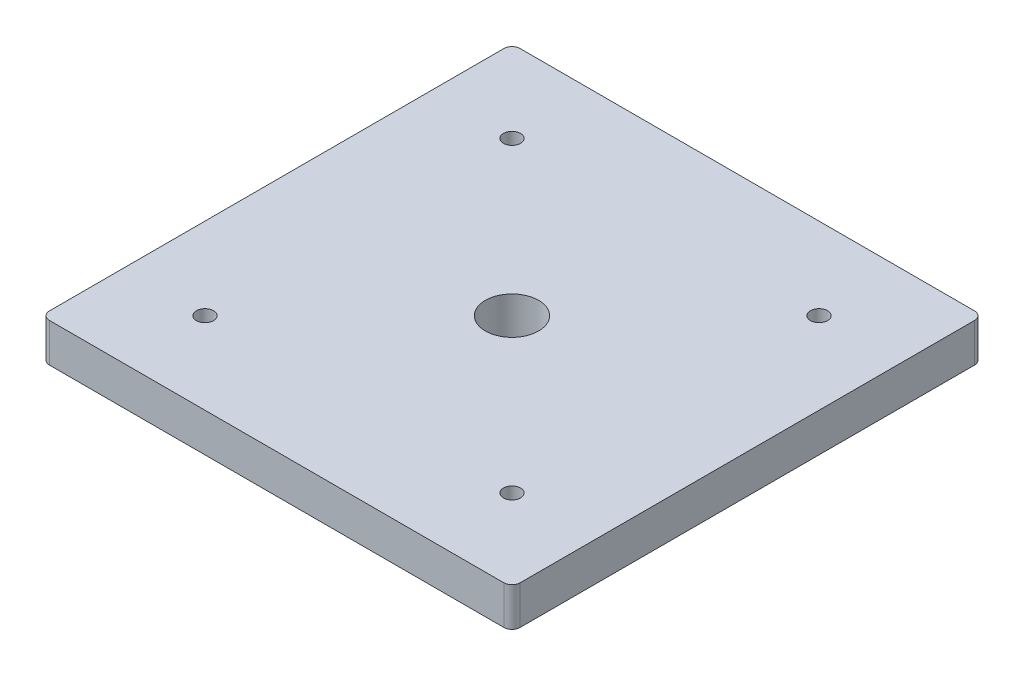
ISO-10303-21;
HEADER;
FILE_DESCRIPTION(('STEP AP214'),'2;1');
FILE_NAME('part.step','',(''),(''),'','','');
FILE_SCHEMA(('AUTOMOTIVE_DESIGN { 1 0 10303 214 1 1 1 1 }'));
ENDSEC;
DATA;
#1=APPLICATION_CONTEXT('core data for automotive mechanical design processes');
#2=APPLICATION_PROTOCOL_DEFINITION('international standard','automotive_design',2000,#1);
#3=PRODUCT_CONTEXT('',#1,'mechanical');
#4=PRODUCT('Part','Part','',(#3));
#5=PRODUCT_RELATED_PRODUCT_CATEGORY('part','',(#4));
#6=PRODUCT_DEFINITION_FORMATION('','',#4);
#7=PRODUCT_DEFINITION_CONTEXT('part definition',#1,'design');
#8=PRODUCT_DEFINITION('design','',#6,#7);
#9=PRODUCT_DEFINITION_SHAPE('','',#8);
#10=(LENGTH_UNIT() NAMED_UNIT(*) SI_UNIT(.MILLI.,.METRE.));
#11=(NAMED_UNIT(*) PLANE_ANGLE_UNIT() SI_UNIT($,.RADIAN.));
#12=(NAMED_UNIT(*) SI_UNIT($,.STERADIAN.) SOLID_ANGLE_UNIT());
#13=UNCERTAINTY_MEASURE_WITH_UNIT(LENGTH_MEASURE(1.E-05),#10,'distance_accuracy_value','');
#14=(GEOMETRIC_REPRESENTATION_CONTEXT(3) GLOBAL_UNCERTAINTY_ASSIGNED_CONTEXT((#13)) GLOBAL_UNIT_ASSIGNED_CONTEXT((#10,
#11,#12)) REPRESENTATION_CONTEXT('',''));
#15=CARTESIAN_POINT('',(0.,0.,0.));
#16=DIRECTION('',(0.,0.,1.));
#17=DIRECTION('',(1.,0.,0.));
#18=AXIS2_PLACEMENT_3D('',#15,#16,#17);
#19=CARTESIAN_POINT('',(-47.6250000000001,5.460000002,-47.6250000000001));
#20=DIRECTION('',(0.,-1.,0.));
#21=DIRECTION('',(0.,0.,-1.));
#22=AXIS2_PLACEMENT_3D('',#19,#20,#21);
#23=CYLINDRICAL_SURFACE('',#22,7.9375);
#24=CARTESIAN_POINT('',(-47.6250000000001,5.460000002,-47.6250000000001));
#25=DIRECTION('',(0.,-1.,0.));
#26=DIRECTION('',(0.,0.,-1.));
#27=AXIS2_PLACEMENT_3D('',#24,#25,#26);
#28=CIRCLE('',#27,7.9375);
#29=CARTESIAN_POINT('',(-47.6250000000001,5.460000002,-55.5625000000001));
#30=VERTEX_POINT('',#29);
#31=EDGE_CURVE('E180',#30,#30,#28,.T.);
#32=ORIENTED_EDGE('',*,*,#31,.F.);
#33=EDGE_LOOP('',(#32));
#34=FACE_BOUND('',#33,.T.);
#35=CARTESIAN_POINT('',(-47.6250000000001,0.,-47.6250000000001));
#36=DIRECTION('',(0.,-1.,0.));
#37=DIRECTION('',(0.,0.,-1.));
#38=AXIS2_PLACEMENT_3D('',#35,#36,#37);
#39=CIRCLE('',#38,7.9375);
#40=CARTESIAN_POINT('',(-47.6250000000001,0.,-55.5625000000001));
#41=VERTEX_POINT('',#40);
#42=EDGE_CURVE('E177',#41,#41,#39,.T.);
#43=ORIENTED_EDGE('',*,*,#42,.T.);
#44=EDGE_LOOP('',(#43));
#45=FACE_BOUND('',#44,.T.);
#46=ADVANCED_FACE('F17',(#34,#45),#23,.F.);
#47=CARTESIAN_POINT('',(47.6249999999999,5.460000002,-47.6250000000001));
#48=DIRECTION('',(0.,-1.,0.));
#49=DIRECTION('',(0.,0.,-1.));
#50=AXIS2_PLACEMENT_3D('',#47,#48,#49);
#51=CYLINDRICAL_SURFACE('',#50,7.9375);
#52=CARTESIAN_POINT('',(47.6249999999999,5.460000002,-47.6250000000001));
#53=DIRECTION('',(0.,-1.,0.));
#54=DIRECTION('',(0.,0.,-1.));
#55=AXIS2_PLACEMENT_3D('',#52,#53,#54);
#56=CIRCLE('',#55,7.9375);
#57=CARTESIAN_POINT('',(47.6249999999999,5.460000002,-55.5625000000001));
#58=VERTEX_POINT('',#57);
#59=EDGE_CURVE('E183',#58,#58,#56,.T.);
#60=ORIENTED_EDGE('',*,*,#59,.F.);
#61=EDGE_LOOP('',(#60));
#62=FACE_BOUND('',#61,.T.);
#63=CARTESIAN_POINT('',(47.6249999999999,0.,-47.6250000000001));
#64=DIRECTION('',(0.,-1.,0.));
#65=DIRECTION('',(0.,0.,-1.));
#66=AXIS2_PLACEMENT_3D('',#63,#64,#65);
#67=CIRCLE('',#66,7.9375);
#68=CARTESIAN_POINT('',(47.6249999999999,0.,-55.5625000000001));
#69=VERTEX_POINT('',#68);
#70=EDGE_CURVE('E174',#69,#69,#67,.T.);
#71=ORIENTED_EDGE('',*,*,#70,.T.);
#72=EDGE_LOOP('',(#71));
#73=FACE_BOUND('',#72,.T.);
#74=ADVANCED_FACE('F213',(#62,#73),#51,.F.);
#75=CARTESIAN_POINT('',(47.625,5.460000002,47.6249999999999));
#76=DIRECTION('',(0.,-1.,0.));
#77=DIRECTION('',(0.,0.,-1.));
#78=AXIS2_PLACEMENT_3D('',#75,#76,#77);
#79=CYLINDRICAL_SURFACE('',#78,7.9375);
#80=CARTESIAN_POINT('',(47.625,5.460000002,47.6249999999999));
#81=DIRECTION('',(0.,-1.,0.));
#82=DIRECTION('',(0.,0.,-1.));
#83=AXIS2_PLACEMENT_3D('',#80,#81,#82);
#84=CIRCLE('',#83,7.9375);
#85=CARTESIAN_POINT('',(47.625,5.460000002,39.6874999999999));
#86=VERTEX_POINT('',#85);
#87=EDGE_CURVE('E185',#86,#86,#84,.T.);
#88=ORIENTED_EDGE('',*,*,#87,.F.);
#89=EDGE_LOOP('',(#88));
#90=FACE_BOUND('',#89,.T.);
#91=CARTESIAN_POINT('',(47.625,0.,47.6249999999999));
#92=DIRECTION('',(0.,-1.,0.));
#93=DIRECTION('',(0.,0.,-1.));
#94=AXIS2_PLACEMENT_3D('',#91,#92,#93);
#95=CIRCLE('',#94,7.9375);
#96=CARTESIAN_POINT('',(47.625,0.,39.6874999999999));
#97=VERTEX_POINT('',#96);
#98=EDGE_CURVE('E171',#97,#97,#95,.T.);
#99=ORIENTED_EDGE('',*,*,#98,.T.);
#100=EDGE_LOOP('',(#99));
#101=FACE_BOUND('',#100,.T.);
#102=ADVANCED_FACE('F197',(#90,#101),#79,.F.);
#103=CARTESIAN_POINT('',(-47.625,5.460000002,47.6249999999999));
#104=DIRECTION('',(0.,-1.,0.));
#105=DIRECTION('',(0.,0.,-1.));
#106=AXIS2_PLACEMENT_3D('',#103,#104,#105);
#107=CYLINDRICAL_SURFACE('',#106,7.9375);
#108=CARTESIAN_POINT('',(-47.625,5.460000002,47.6249999999999));
#109=DIRECTION('',(0.,-1.,0.));
#110=DIRECTION('',(0.,0.,-1.));
#111=AXIS2_PLACEMENT_3D('',#108,#109,#110);
#112=CIRCLE('',#111,7.9375);
#113=CARTESIAN_POINT('',(-47.625,5.460000002,39.6874999999999));
#114=VERTEX_POINT('',#113);
#115=EDGE_CURVE('E20',#114,#114,#112,.T.);
#116=ORIENTED_EDGE('',*,*,#115,.F.);
#117=EDGE_LOOP('',(#116));
#118=FACE_BOUND('',#117,.T.);
#119=CARTESIAN_POINT('',(-47.625,0.,47.6249999999999));
#120=DIRECTION('',(0.,-1.,0.));
#121=DIRECTION('',(0.,0.,-1.));
#122=AXIS2_PLACEMENT_3D('',#119,#120,#121);
#123=CIRCLE('',#122,7.9375);
#124=CARTESIAN_POINT('',(-47.625,0.,39.6874999999999));
#125=VERTEX_POINT('',#124);
#126=EDGE_CURVE('E168',#125,#125,#123,.T.);
#127=ORIENTED_EDGE('',*,*,#126,.T.);
#128=EDGE_LOOP('',(#127));
#129=FACE_BOUND('',#128,.T.);
#130=ADVANCED_FACE('F194',(#118,#129),#107,.F.);
#131=CARTESIAN_POINT('',(-47.625,5.460000002,47.6249999999999));
#132=DIRECTION('',(0.,-1.,0.));
#133=DIRECTION('',(0.,0.,-1.));
#134=AXIS2_PLACEMENT_3D('',#131,#132,#133);
#135=PLANE('',#134);
#136=CARTESIAN_POINT('',(-47.625,5.460000002,47.6249999999999));
#137=DIRECTION('',(0.,-1.,0.));
#138=DIRECTION('',(0.,0.,-1.));
#139=AXIS2_PLACEMENT_3D('',#136,#137,#138);
#140=CIRCLE('',#139,2.667);
#141=CARTESIAN_POINT('',(-47.625,5.460000002,44.9579999999999));
#142=VERTEX_POINT('',#141);
#143=EDGE_CURVE('E165',#142,#142,#140,.F.);
#144=ORIENTED_EDGE('',*,*,#143,.T.);
#145=EDGE_LOOP('',(#144));
#146=FACE_BOUND('',#145,.T.);
#147=ORIENTED_EDGE('',*,*,#115,.T.);
#148=EDGE_LOOP('',(#147));
#149=FACE_BOUND('',#148,.T.);
#150=ADVANCED_FACE('F192',(#146,#149),#135,.T.);
#151=CARTESIAN_POINT('',(47.625,5.460000002,47.6249999999999));
#152=DIRECTION('',(0.,-1.,0.));
#153=DIRECTION('',(0.,0.,-1.));
#154=AXIS2_PLACEMENT_3D('',#151,#152,#153);
#155=PLANE('',#154);
#156=CARTESIAN_POINT('',(47.625,5.460000002,47.6249999999999));
#157=DIRECTION('',(0.,-1.,0.));
#158=DIRECTION('',(0.,0.,-1.));
#159=AXIS2_PLACEMENT_3D('',#156,#157,#158);
#160=CIRCLE('',#159,2.667);
#161=CARTESIAN_POINT('',(47.625,5.460000002,44.9579999999999));
#162=VERTEX_POINT('',#161);
#163=EDGE_CURVE('E162',#162,#162,#160,.F.);
#164=ORIENTED_EDGE('',*,*,#163,.T.);
#165=EDGE_LOOP('',(#164));
#166=FACE_BOUND('',#165,.T.);
#167=ORIENTED_EDGE('',*,*,#87,.T.);
#168=EDGE_LOOP('',(#167));
#169=FACE_BOUND('',#168,.T.);
#170=ADVANCED_FACE('F280',(#166,#169),#155,.T.);
#171=CARTESIAN_POINT('',(47.6249999999999,5.460000002,-47.6250000000001));
#172=DIRECTION('',(0.,-1.,0.));
#173=DIRECTION('',(0.,0.,-1.));
#174=AXIS2_PLACEMENT_3D('',#171,#172,#173);
#175=PLANE('',#174);
#176=CARTESIAN_POINT('',(47.6249999999999,5.460000002,-47.6250000000001));
#177=DIRECTION('',(0.,-1.,0.));
#178=DIRECTION('',(0.,0.,-1.));
#179=AXIS2_PLACEMENT_3D('',#176,#177,#178);
#180=CIRCLE('',#179,2.667);
#181=CARTESIAN_POINT('',(47.6249999999999,5.460000002,-50.2920000000001));
#182=VERTEX_POINT('',#181);
#183=EDGE_CURVE('E159',#182,#182,#180,.F.);
#184=ORIENTED_EDGE('',*,*,#183,.T.);
#185=EDGE_LOOP('',(#184));
#186=FACE_BOUND('',#185,.T.);
#187=ORIENTED_EDGE('',*,*,#59,.T.);
#188=EDGE_LOOP('',(#187));
#189=FACE_BOUND('',#188,.T.);
#190=ADVANCED_FACE('F276',(#186,#189),#175,.T.);
#191=CARTESIAN_POINT('',(-47.6250000000001,5.460000002,-47.6250000000001));
#192=DIRECTION('',(0.,-1.,0.));
#193=DIRECTION('',(0.,0.,-1.));
#194=AXIS2_PLACEMENT_3D('',#191,#192,#193);
#195=PLANE('',#194);
#196=CARTESIAN_POINT('',(-47.6250000000001,5.460000002,-47.6250000000001));
#197=DIRECTION('',(0.,-1.,0.));
#198=DIRECTION('',(0.,0.,-1.));
#199=AXIS2_PLACEMENT_3D('',#196,#197,#198);
#200=CIRCLE('',#199,2.667);
#201=CARTESIAN_POINT('',(-47.6250000000001,5.460000002,-50.2920000000001));
#202=VERTEX_POINT('',#201);
#203=EDGE_CURVE('E113',#202,#202,#200,.F.);
#204=ORIENTED_EDGE('',*,*,#203,.T.);
#205=EDGE_LOOP('',(#204));
#206=FACE_BOUND('',#205,.T.);
#207=ORIENTED_EDGE('',*,*,#31,.T.);
#208=EDGE_LOOP('',(#207));
#209=FACE_BOUND('',#208,.T.);
#210=ADVANCED_FACE('F203',(#206,#209),#195,.T.);
#211=CARTESIAN_POINT('',(0.,0.,0.));
#212=DIRECTION('',(0.,1.,0.));
#213=DIRECTION('',(0.,0.,1.));
#214=AXIS2_PLACEMENT_3D('',#211,#212,#213);
#215=PLANE('',#214);
#216=CARTESIAN_POINT('',(0.,0.,0.));
#217=DIRECTION('',(0.,-1.,0.));
#218=DIRECTION('',(0.,0.,-1.));
#219=AXIS2_PLACEMENT_3D('',#216,#217,#218);
#220=CIRCLE('',#219,8.255);
#221=CARTESIAN_POINT('',(0.,0.,-8.255));
#222=VERTEX_POINT('',#221);
#223=EDGE_CURVE('E146',#222,#222,#220,.F.);
#224=ORIENTED_EDGE('',*,*,#223,.T.);
#225=EDGE_LOOP('',(#224));
#226=FACE_BOUND('',#225,.T.);
#227=CARTESIAN_POINT('',(-70.485,0.,-70.485));
#228=DIRECTION('',(0.,-1.,0.));
#229=DIRECTION('',(0.,0.,-1.));
#230=AXIS2_PLACEMENT_3D('',#227,#228,#229);
#231=CIRCLE('',#230,2.54);
#232=CARTESIAN_POINT('',(-70.485,0.,-73.025));
#233=VERTEX_POINT('',#232);
#234=CARTESIAN_POINT('',(-73.025,0.,-70.485));
#235=VERTEX_POINT('',#234);
#236=EDGE_CURVE('E87',#233,#235,#231,.F.);
#237=ORIENTED_EDGE('',*,*,#236,.F.);
#238=DIRECTION('',(1.,0.,0.));
#239=VECTOR('',#238,1.);
#240=CARTESIAN_POINT('',(73.025,0.,-73.025));
#241=LINE('',#240,#239);
#242=CARTESIAN_POINT('',(70.485,0.,-73.025));
#243=VERTEX_POINT('',#242);
#244=EDGE_CURVE('E78',#233,#243,#241,.T.);
#245=ORIENTED_EDGE('',*,*,#244,.T.);
#246=CARTESIAN_POINT('',(70.485,0.,-70.485));
#247=DIRECTION('',(0.,-1.,0.));
#248=DIRECTION('',(0.,0.,-1.));
#249=AXIS2_PLACEMENT_3D('',#246,#247,#248);
#250=CIRCLE('',#249,2.54);
#251=CARTESIAN_POINT('',(73.025,0.,-70.485));
#252=VERTEX_POINT('',#251);
#253=EDGE_CURVE('E150',#252,#243,#250,.F.);
#254=ORIENTED_EDGE('',*,*,#253,.F.);
#255=DIRECTION('',(0.,0.,1.));
#256=VECTOR('',#255,1.);
#257=CARTESIAN_POINT('',(73.025,0.,73.025));
#258=LINE('',#257,#256);
#259=CARTESIAN_POINT('',(73.025,0.,70.485));
#260=VERTEX_POINT('',#259);
#261=EDGE_CURVE('E114',#252,#260,#258,.T.);
#262=ORIENTED_EDGE('',*,*,#261,.T.);
#263=CARTESIAN_POINT('',(70.485,0.,70.485));
#264=DIRECTION('',(0.,-1.,0.));
#265=DIRECTION('',(0.,0.,-1.));
#266=AXIS2_PLACEMENT_3D('',#263,#264,#265);
#267=CIRCLE('',#266,2.54);
#268=CARTESIAN_POINT('',(70.485,0.,73.025));
#269=VERTEX_POINT('',#268);
#270=EDGE_CURVE('E153',#269,#260,#267,.F.);
#271=ORIENTED_EDGE('',*,*,#270,.F.);
#272=DIRECTION('',(-1.,0.,0.));
#273=VECTOR('',#272,1.);
#274=CARTESIAN_POINT('',(73.025,0.,73.025));
#275=LINE('',#274,#273);
#276=CARTESIAN_POINT('',(-70.485,0.,73.025));
#277=VERTEX_POINT('',#276);
#278=EDGE_CURVE('E118',#269,#277,#275,.T.);
#279=ORIENTED_EDGE('',*,*,#278,.T.);
#280=CARTESIAN_POINT('',(-70.485,0.,70.485));
#281=DIRECTION('',(0.,-1.,0.));
#282=DIRECTION('',(0.,0.,-1.));
#283=AXIS2_PLACEMENT_3D('',#280,#281,#282);
#284=CIRCLE('',#283,2.54);
#285=CARTESIAN_POINT('',(-73.025,0.,70.485));
#286=VERTEX_POINT('',#285);
#287=EDGE_CURVE('E90',#286,#277,#284,.F.);
#288=ORIENTED_EDGE('',*,*,#287,.F.);
#289=DIRECTION('',(0.,0.,-1.));
#290=VECTOR('',#289,1.);
#291=CARTESIAN_POINT('',(-73.025,0.,73.025));
#292=LINE('',#291,#290);
#293=EDGE_CURVE('E83',#286,#235,#292,.T.);
#294=ORIENTED_EDGE('',*,*,#293,.T.);
#295=EDGE_LOOP('',(#237,#245,#254,#262,#271,#279,#288,#294));
#296=FACE_BOUND('',#295,.T.);
#297=ORIENTED_EDGE('',*,*,#126,.F.);
#298=EDGE_LOOP('',(#297));
#299=FACE_BOUND('',#298,.T.);
#300=ORIENTED_EDGE('',*,*,#98,.F.);
#301=EDGE_LOOP('',(#300));
#302=FACE_BOUND('',#301,.T.);
#303=ORIENTED_EDGE('',*,*,#70,.F.);
#304=EDGE_LOOP('',(#303));
#305=FACE_BOUND('',#304,.T.);
#306=ORIENTED_EDGE('',*,*,#42,.F.);
#307=EDGE_LOOP('',(#306));
#308=FACE_BOUND('',#307,.T.);
#309=ADVANCED_FACE('F85',(#226,#296,#299,#302,#305,#308),#215,.F.);
#310=CARTESIAN_POINT('',(-47.625,12.,47.6249999999999));
#311=DIRECTION('',(0.,-1.,0.));
#312=DIRECTION('',(0.,0.,-1.));
#313=AXIS2_PLACEMENT_3D('',#310,#311,#312);
#314=CYLINDRICAL_SURFACE('',#313,2.667);
#315=ORIENTED_EDGE('',*,*,#143,.F.);
#316=EDGE_LOOP('',(#315));
#317=FACE_BOUND('',#316,.T.);
#318=CARTESIAN_POINT('',(-47.625,12.,47.6249999999999));
#319=DIRECTION('',(0.,-1.,0.));
#320=DIRECTION('',(0.,0.,-1.));
#321=AXIS2_PLACEMENT_3D('',#318,#319,#320);
#322=CIRCLE('',#321,2.667);
#323=CARTESIAN_POINT('',(-47.625,12.,44.9579999999999));
#324=VERTEX_POINT('',#323);
#325=EDGE_CURVE('E143',#324,#324,#322,.T.);
#326=ORIENTED_EDGE('',*,*,#325,.F.);
#327=EDGE_LOOP('',(#326));
#328=FACE_BOUND('',#327,.T.);
#329=ADVANCED_FACE('F202',(#317,#328),#314,.F.);
#330=CARTESIAN_POINT('',(47.625,12.,47.6249999999999));
#331=DIRECTION('',(0.,-1.,0.));
#332=DIRECTION('',(0.,0.,-1.));
#333=AXIS2_PLACEMENT_3D('',#330,#331,#332);
#334=CYLINDRICAL_SURFACE('',#333,2.667);
#335=ORIENTED_EDGE('',*,*,#163,.F.);
#336=EDGE_LOOP('',(#335));
#337=FACE_BOUND('',#336,.T.);
#338=CARTESIAN_POINT('',(47.625,12.,47.6249999999999));
#339=DIRECTION('',(0.,-1.,0.));
#340=DIRECTION('',(0.,0.,-1.));
#341=AXIS2_PLACEMENT_3D('',#338,#339,#340);
#342=CIRCLE('',#341,2.667);
#343=CARTESIAN_POINT('',(47.625,12.,44.9579999999999));
#344=VERTEX_POINT('',#343);
#345=EDGE_CURVE('E140',#344,#344,#342,.T.);
#346=ORIENTED_EDGE('',*,*,#345,.F.);
#347=EDGE_LOOP('',(#346));
#348=FACE_BOUND('',#347,.T.);
#349=ADVANCED_FACE('F266',(#337,#348),#334,.F.);
#350=CARTESIAN_POINT('',(47.6249999999999,12.,-47.6250000000001));
#351=DIRECTION('',(0.,-1.,0.));
#352=DIRECTION('',(0.,0.,-1.));
#353=AXIS2_PLACEMENT_3D('',#350,#351,#352);
#354=CYLINDRICAL_SURFACE('',#353,2.667);
#355=ORIENTED_EDGE('',*,*,#183,.F.);
#356=EDGE_LOOP('',(#355));
#357=FACE_BOUND('',#356,.T.);
#358=CARTESIAN_POINT('',(47.6249999999999,12.,-47.6250000000001));
#359=DIRECTION('',(0.,-1.,0.));
#360=DIRECTION('',(0.,0.,-1.));
#361=AXIS2_PLACEMENT_3D('',#358,#359,#360);
#362=CIRCLE('',#361,2.667);
#363=CARTESIAN_POINT('',(47.6249999999999,12.,-50.2920000000001));
#364=VERTEX_POINT('',#363);
#365=EDGE_CURVE('E137',#364,#364,#362,.T.);
#366=ORIENTED_EDGE('',*,*,#365,.F.);
#367=EDGE_LOOP('',(#366));
#368=FACE_BOUND('',#367,.T.);
#369=ADVANCED_FACE('F262',(#357,#368),#354,.F.);
#370=CARTESIAN_POINT('',(-47.6250000000001,12.,-47.6250000000001));
#371=DIRECTION('',(0.,-1.,0.));
#372=DIRECTION('',(0.,0.,-1.));
#373=AXIS2_PLACEMENT_3D('',#370,#371,#372);
#374=CYLINDRICAL_SURFACE('',#373,2.667);
#375=ORIENTED_EDGE('',*,*,#203,.F.);
#376=EDGE_LOOP('',(#375));
#377=FACE_BOUND('',#376,.T.);
#378=CARTESIAN_POINT('',(-47.6250000000001,12.,-47.6250000000001));
#379=DIRECTION('',(0.,-1.,0.));
#380=DIRECTION('',(0.,0.,-1.));
#381=AXIS2_PLACEMENT_3D('',#378,#379,#380);
#382=CIRCLE('',#381,2.667);
#383=CARTESIAN_POINT('',(-47.6250000000001,12.,-50.2920000000001));
#384=VERTEX_POINT('',#383);
#385=EDGE_CURVE('E134',#384,#384,#382,.T.);
#386=ORIENTED_EDGE('',*,*,#385,.F.);
#387=EDGE_LOOP('',(#386));
#388=FACE_BOUND('',#387,.T.);
#389=ADVANCED_FACE('F259',(#377,#388),#374,.F.);
#390=CARTESIAN_POINT('',(73.025,12.,-73.025));
#391=DIRECTION('',(0.,0.,1.));
#392=DIRECTION('',(1.,0.,0.));
#393=AXIS2_PLACEMENT_3D('',#390,#391,#392);
#394=PLANE('',#393);
#395=DIRECTION('',(0.,-1.,0.));
#396=VECTOR('',#395,1.);
#397=CARTESIAN_POINT('',(-70.485,12.,-73.025));
#398=LINE('',#397,#396);
#399=CARTESIAN_POINT('',(-70.485,12.,-73.025));
#400=VERTEX_POINT('',#399);
#401=EDGE_CURVE('E100',#400,#233,#398,.T.);
#402=ORIENTED_EDGE('',*,*,#401,.F.);
#403=DIRECTION('',(1.,0.,0.));
#404=VECTOR('',#403,1.);
#405=CARTESIAN_POINT('',(0.,12.,-73.025));
#406=LINE('',#405,#404);
#407=CARTESIAN_POINT('',(70.485,12.,-73.025));
#408=VERTEX_POINT('',#407);
#409=EDGE_CURVE('E133',#408,#400,#406,.F.);
#410=ORIENTED_EDGE('',*,*,#409,.F.);
#411=DIRECTION('',(0.,-1.,0.));
#412=VECTOR('',#411,1.);
#413=CARTESIAN_POINT('',(70.485,12.,-73.025));
#414=LINE('',#413,#412);
#415=EDGE_CURVE('E149',#243,#408,#414,.F.);
#416=ORIENTED_EDGE('',*,*,#415,.F.);
#417=ORIENTED_EDGE('',*,*,#244,.F.);
#418=EDGE_LOOP('',(#402,#410,#416,#417));
#419=FACE_BOUND('',#418,.T.);
#420=ADVANCED_FACE('F256',(#419),#394,.F.);
#421=CARTESIAN_POINT('',(-70.485,12.,-70.485));
#422=DIRECTION('',(0.,-1.,0.));
#423=DIRECTION('',(0.,0.,-1.));
#424=AXIS2_PLACEMENT_3D('',#421,#422,#423);
#425=CYLINDRICAL_SURFACE('',#424,2.54);
#426=ORIENTED_EDGE('',*,*,#236,.T.);
#427=DIRECTION('',(0.,1.,0.));
#428=VECTOR('',#427,1.);
#429=CARTESIAN_POINT('',(-73.025,12.,-70.485));
#430=LINE('',#429,#428);
#431=CARTESIAN_POINT('',(-73.025,12.,-70.485));
#432=VERTEX_POINT('',#431);
#433=EDGE_CURVE('E94',#235,#432,#430,.T.);
#434=ORIENTED_EDGE('',*,*,#433,.T.);
#435=CARTESIAN_POINT('',(-70.485,12.,-70.485));
#436=DIRECTION('',(0.,-1.,0.));
#437=DIRECTION('',(0.,0.,-1.));
#438=AXIS2_PLACEMENT_3D('',#435,#436,#437);
#439=CIRCLE('',#438,2.54);
#440=EDGE_CURVE('E131',#400,#432,#439,.F.);
#441=ORIENTED_EDGE('',*,*,#440,.F.);
#442=ORIENTED_EDGE('',*,*,#401,.T.);
#443=EDGE_LOOP('',(#426,#434,#441,#442));
#444=FACE_BOUND('',#443,.T.);
#445=ADVANCED_FACE('F97',(#444),#425,.T.);
#446=CARTESIAN_POINT('',(-73.025,12.,73.025));
#447=DIRECTION('',(1.,0.,0.));
#448=DIRECTION('',(0.,0.,-1.));
#449=AXIS2_PLACEMENT_3D('',#446,#447,#448);
#450=PLANE('',#449);
#451=ORIENTED_EDGE('',*,*,#433,.F.);
#452=ORIENTED_EDGE('',*,*,#293,.F.);
#453=DIRECTION('',(0.,-1.,0.));
#454=VECTOR('',#453,1.);
#455=CARTESIAN_POINT('',(-73.025,12.,70.485));
#456=LINE('',#455,#454);
#457=CARTESIAN_POINT('',(-73.025,12.,70.485));
#458=VERTEX_POINT('',#457);
#459=EDGE_CURVE('E106',#458,#286,#456,.T.);
#460=ORIENTED_EDGE('',*,*,#459,.F.);
#461=DIRECTION('',(0.,0.,1.));
#462=VECTOR('',#461,1.);
#463=CARTESIAN_POINT('',(-73.025,12.,0.));
#464=LINE('',#463,#462);
#465=EDGE_CURVE('E104',#432,#458,#464,.T.);
#466=ORIENTED_EDGE('',*,*,#465,.F.);
#467=EDGE_LOOP('',(#451,#452,#460,#466));
#468=FACE_BOUND('',#467,.T.);
#469=ADVANCED_FACE('F102',(#468),#450,.F.);
#470=CARTESIAN_POINT('',(-70.485,12.,70.485));
#471=DIRECTION('',(0.,-1.,0.));
#472=DIRECTION('',(0.,0.,-1.));
#473=AXIS2_PLACEMENT_3D('',#470,#471,#472);
#474=CYLINDRICAL_SURFACE('',#473,2.54);
#475=ORIENTED_EDGE('',*,*,#287,.T.);
#476=DIRECTION('',(0.,1.,0.));
#477=VECTOR('',#476,1.);
#478=CARTESIAN_POINT('',(-70.485,12.,73.025));
#479=LINE('',#478,#477);
#480=CARTESIAN_POINT('',(-70.485,12.,73.025));
#481=VERTEX_POINT('',#480);
#482=EDGE_CURVE('E119',#277,#481,#479,.T.);
#483=ORIENTED_EDGE('',*,*,#482,.T.);
#484=CARTESIAN_POINT('',(-70.485,12.,70.485));
#485=DIRECTION('',(0.,-1.,0.));
#486=DIRECTION('',(0.,0.,-1.));
#487=AXIS2_PLACEMENT_3D('',#484,#485,#486);
#488=CIRCLE('',#487,2.54);
#489=EDGE_CURVE('E128',#458,#481,#488,.F.);
#490=ORIENTED_EDGE('',*,*,#489,.F.);
#491=ORIENTED_EDGE('',*,*,#459,.T.);
#492=EDGE_LOOP('',(#475,#483,#490,#491));
#493=FACE_BOUND('',#492,.T.);
#494=ADVANCED_FACE('F247',(#493),#474,.T.);
#495=CARTESIAN_POINT('',(73.025,12.,73.025));
#496=DIRECTION('',(0.,0.,-1.));
#497=DIRECTION('',(-1.,0.,0.));
#498=AXIS2_PLACEMENT_3D('',#495,#496,#497);
#499=PLANE('',#498);
#500=ORIENTED_EDGE('',*,*,#482,.F.);
#501=ORIENTED_EDGE('',*,*,#278,.F.);
#502=DIRECTION('',(0.,-1.,0.));
#503=VECTOR('',#502,1.);
#504=CARTESIAN_POINT('',(70.485,12.,73.025));
#505=LINE('',#504,#503);
#506=CARTESIAN_POINT('',(70.485,12.,73.025));
#507=VERTEX_POINT('',#506);
#508=EDGE_CURVE('E155',#507,#269,#505,.T.);
#509=ORIENTED_EDGE('',*,*,#508,.F.);
#510=DIRECTION('',(1.,0.,0.));
#511=VECTOR('',#510,1.);
#512=CARTESIAN_POINT('',(0.,12.,73.025));
#513=LINE('',#512,#511);
#514=EDGE_CURVE('E127',#481,#507,#513,.T.);
#515=ORIENTED_EDGE('',*,*,#514,.F.);
#516=EDGE_LOOP('',(#500,#501,#509,#515));
#517=FACE_BOUND('',#516,.T.);
#518=ADVANCED_FACE('F243',(#517),#499,.F.);
#519=CARTESIAN_POINT('',(70.485,12.,70.485));
#520=DIRECTION('',(0.,-1.,0.));
#521=DIRECTION('',(0.,0.,-1.));
#522=AXIS2_PLACEMENT_3D('',#519,#520,#521);
#523=CYLINDRICAL_SURFACE('',#522,2.54);
#524=ORIENTED_EDGE('',*,*,#270,.T.);
#525=DIRECTION('',(0.,1.,0.));
#526=VECTOR('',#525,1.);
#527=CARTESIAN_POINT('',(73.025,12.,70.485));
#528=LINE('',#527,#526);
#529=CARTESIAN_POINT('',(73.025,12.,70.485));
#530=VERTEX_POINT('',#529);
#531=EDGE_CURVE('E117',#260,#530,#528,.T.);
#532=ORIENTED_EDGE('',*,*,#531,.T.);
#533=CARTESIAN_POINT('',(70.485,12.,70.485));
#534=DIRECTION('',(0.,-1.,0.));
#535=DIRECTION('',(0.,0.,-1.));
#536=AXIS2_PLACEMENT_3D('',#533,#534,#535);
#537=CIRCLE('',#536,2.54);
#538=EDGE_CURVE('E124',#507,#530,#537,.F.);
#539=ORIENTED_EDGE('',*,*,#538,.F.);
#540=ORIENTED_EDGE('',*,*,#508,.T.);
#541=EDGE_LOOP('',(#524,#532,#539,#540));
#542=FACE_BOUND('',#541,.T.);
#543=ADVANCED_FACE('F240',(#542),#523,.T.);
#544=CARTESIAN_POINT('',(73.025,12.,73.025));
#545=DIRECTION('',(-1.,0.,0.));
#546=DIRECTION('',(0.,0.,1.));
#547=AXIS2_PLACEMENT_3D('',#544,#545,#546);
#548=PLANE('',#547);
#549=DIRECTION('',(0.,-1.,0.));
#550=VECTOR('',#549,1.);
#551=CARTESIAN_POINT('',(73.025,12.,-70.485));
#552=LINE('',#551,#550);
#553=CARTESIAN_POINT('',(73.025,12.,-70.485));
#554=VERTEX_POINT('',#553);
#555=EDGE_CURVE('E35',#554,#252,#552,.T.);
#556=ORIENTED_EDGE('',*,*,#555,.F.);
#557=DIRECTION('',(0.,0.,1.));
#558=VECTOR('',#557,1.);
#559=CARTESIAN_POINT('',(73.025,12.,0.));
#560=LINE('',#559,#558);
#561=EDGE_CURVE('E123',#530,#554,#560,.F.);
#562=ORIENTED_EDGE('',*,*,#561,.F.);
#563=ORIENTED_EDGE('',*,*,#531,.F.);
#564=ORIENTED_EDGE('',*,*,#261,.F.);
#565=EDGE_LOOP('',(#556,#562,#563,#564));
#566=FACE_BOUND('',#565,.T.);
#567=ADVANCED_FACE('F236',(#566),#548,.F.);
#568=CARTESIAN_POINT('',(70.485,12.,-70.485));
#569=DIRECTION('',(0.,-1.,0.));
#570=DIRECTION('',(0.,0.,-1.));
#571=AXIS2_PLACEMENT_3D('',#568,#569,#570);
#572=CYLINDRICAL_SURFACE('',#571,2.54);
#573=ORIENTED_EDGE('',*,*,#253,.T.);
#574=ORIENTED_EDGE('',*,*,#415,.T.);
#575=CARTESIAN_POINT('',(70.485,12.,-70.485));
#576=DIRECTION('',(0.,-1.,0.));
#577=DIRECTION('',(0.,0.,-1.));
#578=AXIS2_PLACEMENT_3D('',#575,#576,#577);
#579=CIRCLE('',#578,2.54);
#580=EDGE_CURVE('E26',#554,#408,#579,.F.);
#581=ORIENTED_EDGE('',*,*,#580,.F.);
#582=ORIENTED_EDGE('',*,*,#555,.T.);
#583=EDGE_LOOP('',(#573,#574,#581,#582));
#584=FACE_BOUND('',#583,.T.);
#585=ADVANCED_FACE('F229',(#584),#572,.T.);
#586=CARTESIAN_POINT('',(0.,12.,0.));
#587=DIRECTION('',(0.,-1.,0.));
#588=DIRECTION('',(0.,0.,-1.));
#589=AXIS2_PLACEMENT_3D('',#586,#587,#588);
#590=CYLINDRICAL_SURFACE('',#589,8.255);
#591=CARTESIAN_POINT('',(0.,12.,0.));
#592=DIRECTION('',(0.,-1.,0.));
#593=DIRECTION('',(0.,0.,-1.));
#594=AXIS2_PLACEMENT_3D('',#591,#592,#593);
#595=CIRCLE('',#594,8.255);
#596=CARTESIAN_POINT('',(0.,12.,-8.255));
#597=VERTEX_POINT('',#596);
#598=EDGE_CURVE('E11',#597,#597,#595,.T.);
#599=ORIENTED_EDGE('',*,*,#598,.F.);
#600=EDGE_LOOP('',(#599));
#601=FACE_BOUND('',#600,.T.);
#602=ORIENTED_EDGE('',*,*,#223,.F.);
#603=EDGE_LOOP('',(#602));
#604=FACE_BOUND('',#603,.T.);
#605=ADVANCED_FACE('F223',(#601,#604),#590,.F.);
#606=CARTESIAN_POINT('',(0.,12.,0.));
#607=DIRECTION('',(0.,1.,0.));
#608=DIRECTION('',(0.,0.,1.));
#609=AXIS2_PLACEMENT_3D('',#606,#607,#608);
#610=PLANE('',#609);
#611=ORIENTED_EDGE('',*,*,#598,.T.);
#612=EDGE_LOOP('',(#611));
#613=FACE_BOUND('',#612,.T.);
#614=ORIENTED_EDGE('',*,*,#561,.T.);
#615=ORIENTED_EDGE('',*,*,#580,.T.);
#616=ORIENTED_EDGE('',*,*,#409,.T.);
#617=ORIENTED_EDGE('',*,*,#440,.T.);
#618=ORIENTED_EDGE('',*,*,#465,.T.);
#619=ORIENTED_EDGE('',*,*,#489,.T.);
#620=ORIENTED_EDGE('',*,*,#514,.T.);
#621=ORIENTED_EDGE('',*,*,#538,.T.);
#622=EDGE_LOOP('',(#614,#615,#616,#617,#618,#619,#620,#621));
#623=FACE_BOUND('',#622,.T.);
#624=ORIENTED_EDGE('',*,*,#385,.T.);
#625=EDGE_LOOP('',(#624));
#626=FACE_BOUND('',#625,.T.);
#627=ORIENTED_EDGE('',*,*,#365,.T.);
#628=EDGE_LOOP('',(#627));
#629=FACE_BOUND('',#628,.T.);
#630=ORIENTED_EDGE('',*,*,#345,.T.);
#631=EDGE_LOOP('',(#630));
#632=FACE_BOUND('',#631,.T.);
#633=ORIENTED_EDGE('',*,*,#325,.T.);
#634=EDGE_LOOP('',(#633));
#635=FACE_BOUND('',#634,.T.);
#636=ADVANCED_FACE('F221',(#613,#623,#626,#629,#632,#635),#610,.T.);
#637=CLOSED_SHELL('',(#46,#74,#102,#130,#150,#170,#190,#210,#309,#329,#349,#369,#389,#420,#445,
#469,#494,#518,#543,#567,#585,#605,#636));
#638=MANIFOLD_SOLID_BREP('B1',#637);
#639=ADVANCED_BREP_SHAPE_REPRESENTATION('',(#18,#638),#14);
#640=SHAPE_DEFINITION_REPRESENTATION(#9,#639);
ENDSEC;
END-ISO-10303-21;
